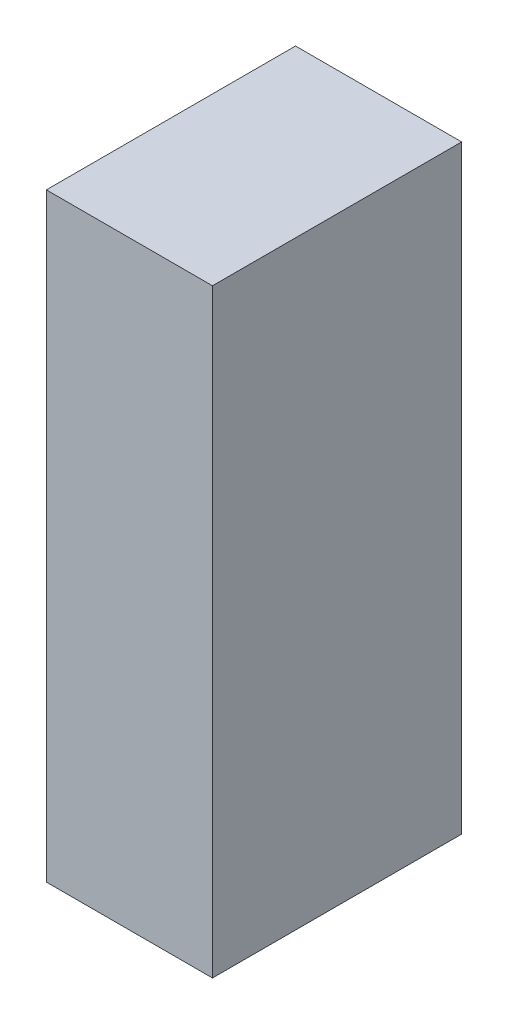
ISO-10303-21;
HEADER;
FILE_DESCRIPTION(('STEP AP214'),'2;1');
FILE_NAME('part.step','',(''),(''),'','','');
FILE_SCHEMA(('AUTOMOTIVE_DESIGN { 1 0 10303 214 1 1 1 1 }'));
ENDSEC;
DATA;
#1=APPLICATION_CONTEXT('core data for automotive mechanical design processes');
#2=APPLICATION_PROTOCOL_DEFINITION('international standard','automotive_design',2000,#1);
#3=PRODUCT_CONTEXT('',#1,'mechanical');
#4=PRODUCT('Part','Part','',(#3));
#5=PRODUCT_RELATED_PRODUCT_CATEGORY('part','',(#4));
#6=PRODUCT_DEFINITION_FORMATION('','',#4);
#7=PRODUCT_DEFINITION_CONTEXT('part definition',#1,'design');
#8=PRODUCT_DEFINITION('design','',#6,#7);
#9=PRODUCT_DEFINITION_SHAPE('','',#8);
#10=(LENGTH_UNIT() NAMED_UNIT(*) SI_UNIT(.MILLI.,.METRE.));
#11=(NAMED_UNIT(*) PLANE_ANGLE_UNIT() SI_UNIT($,.RADIAN.));
#12=(NAMED_UNIT(*) SI_UNIT($,.STERADIAN.) SOLID_ANGLE_UNIT());
#13=UNCERTAINTY_MEASURE_WITH_UNIT(LENGTH_MEASURE(1.E-05),#10,'distance_accuracy_value','');
#14=(GEOMETRIC_REPRESENTATION_CONTEXT(3) GLOBAL_UNCERTAINTY_ASSIGNED_CONTEXT((#13)) GLOBAL_UNIT_ASSIGNED_CONTEXT((#10,
#11,#12)) REPRESENTATION_CONTEXT('',''));
#15=CARTESIAN_POINT('',(0.,0.,0.));
#16=DIRECTION('',(0.,0.,1.));
#17=DIRECTION('',(1.,0.,0.));
#18=AXIS2_PLACEMENT_3D('',#15,#16,#17);
#19=CARTESIAN_POINT('',(0.07620254,0.27500072,0.));
#20=DIRECTION('',(1.,0.,0.));
#21=DIRECTION('',(0.,0.,-1.));
#22=AXIS2_PLACEMENT_3D('',#19,#20,#21);
#23=PLANE('',#22);
#24=DIRECTION('',(0.,0.,-1.));
#25=VECTOR('',#24,1.);
#26=CARTESIAN_POINT('',(0.07620254,-0.27500072,0.));
#27=LINE('',#26,#25);
#28=CARTESIAN_POINT('',(0.07620254,-0.27500072,0.));
#29=VERTEX_POINT('',#28);
#30=CARTESIAN_POINT('',(0.07620254,-0.27500072,0.2286));
#31=VERTEX_POINT('',#30);
#32=EDGE_CURVE('E20',#29,#31,#27,.F.);
#33=ORIENTED_EDGE('',*,*,#32,.F.);
#34=DIRECTION('',(0.,1.,0.));
#35=VECTOR('',#34,1.);
#36=CARTESIAN_POINT('',(0.07620254,-0.27500072,0.));
#37=LINE('',#36,#35);
#38=CARTESIAN_POINT('',(0.07620254,0.27500072,0.));
#39=VERTEX_POINT('',#38);
#40=EDGE_CURVE('E80',#29,#39,#37,.T.);
#41=ORIENTED_EDGE('',*,*,#40,.T.);
#42=DIRECTION('',(0.,0.,1.));
#43=VECTOR('',#42,1.);
#44=CARTESIAN_POINT('',(0.07620254,0.27500072,0.));
#45=LINE('',#44,#43);
#46=CARTESIAN_POINT('',(0.07620254,0.27500072,0.2286));
#47=VERTEX_POINT('',#46);
#48=EDGE_CURVE('E68',#47,#39,#45,.F.);
#49=ORIENTED_EDGE('',*,*,#48,.F.);
#50=DIRECTION('',(0.,1.,0.));
#51=VECTOR('',#50,1.);
#52=CARTESIAN_POINT('',(0.07620254,-0.27500072,0.2286));
#53=LINE('',#52,#51);
#54=EDGE_CURVE('E56',#31,#47,#53,.T.);
#55=ORIENTED_EDGE('',*,*,#54,.F.);
#56=EDGE_LOOP('',(#33,#41,#49,#55));
#57=FACE_BOUND('',#56,.T.);
#58=ADVANCED_FACE('F17',(#57),#23,.T.);
#59=CARTESIAN_POINT('',(0.07620254,-0.27500072,0.));
#60=DIRECTION('',(0.,-1.,0.));
#61=DIRECTION('',(0.,0.,-1.));
#62=AXIS2_PLACEMENT_3D('',#59,#60,#61);
#63=PLANE('',#62);
#64=DIRECTION('',(0.,0.,1.));
#65=VECTOR('',#64,1.);
#66=CARTESIAN_POINT('',(-0.07619746,-0.27500072,0.));
#67=LINE('',#66,#65);
#68=CARTESIAN_POINT('',(-0.0761980949999925,-0.27500072,0.));
#69=VERTEX_POINT('',#68);
#70=CARTESIAN_POINT('',(-0.0761980949999925,-0.27500072,0.2286));
#71=VERTEX_POINT('',#70);
#72=EDGE_CURVE('E83',#69,#71,#67,.T.);
#73=ORIENTED_EDGE('',*,*,#72,.F.);
#74=DIRECTION('',(1.,0.,0.));
#75=VECTOR('',#74,1.);
#76=CARTESIAN_POINT('',(-0.07619746,-0.27500072,0.));
#77=LINE('',#76,#75);
#78=EDGE_CURVE('E65',#69,#29,#77,.T.);
#79=ORIENTED_EDGE('',*,*,#78,.T.);
#80=ORIENTED_EDGE('',*,*,#32,.T.);
#81=DIRECTION('',(1.,0.,0.));
#82=VECTOR('',#81,1.);
#83=CARTESIAN_POINT('',(-0.07619746,-0.27500072,0.2286));
#84=LINE('',#83,#82);
#85=EDGE_CURVE('E62',#71,#31,#84,.T.);
#86=ORIENTED_EDGE('',*,*,#85,.F.);
#87=EDGE_LOOP('',(#73,#79,#80,#86));
#88=FACE_BOUND('',#87,.T.);
#89=ADVANCED_FACE('F61',(#88),#63,.T.);
#90=CARTESIAN_POINT('',(-0.07619746,-0.27500072,0.2286));
#91=DIRECTION('',(0.,0.,1.));
#92=DIRECTION('',(1.,0.,0.));
#93=AXIS2_PLACEMENT_3D('',#90,#91,#92);
#94=PLANE('',#93);
#95=DIRECTION('',(1.,0.,0.));
#96=VECTOR('',#95,1.);
#97=CARTESIAN_POINT('',(-0.07619999999997,0.27500072,0.2286));
#98=LINE('',#97,#96);
#99=CARTESIAN_POINT('',(-0.0761999999999697,0.27500072,0.2286));
#100=VERTEX_POINT('',#99);
#101=EDGE_CURVE('E70',#100,#47,#98,.T.);
#102=ORIENTED_EDGE('',*,*,#101,.F.);
#103=DIRECTION('',(4.61816966979355E-06,-0.999999999989336,0.));
#104=VECTOR('',#103,1.);
#105=CARTESIAN_POINT('',(-0.07619746,-0.27500072,0.2286));
#106=LINE('',#105,#104);
#107=EDGE_CURVE('E74',#71,#100,#106,.F.);
#108=ORIENTED_EDGE('',*,*,#107,.F.);
#109=ORIENTED_EDGE('',*,*,#85,.T.);
#110=ORIENTED_EDGE('',*,*,#54,.T.);
#111=EDGE_LOOP('',(#102,#108,#109,#110));
#112=FACE_BOUND('',#111,.T.);
#113=ADVANCED_FACE('F72',(#112),#94,.T.);
#114=CARTESIAN_POINT('',(-0.07619999999997,0.27500072,0.));
#115=DIRECTION('',(0.,1.,0.));
#116=DIRECTION('',(0.,0.,1.));
#117=AXIS2_PLACEMENT_3D('',#114,#115,#116);
#118=PLANE('',#117);
#119=ORIENTED_EDGE('',*,*,#48,.T.);
#120=DIRECTION('',(1.,0.,0.));
#121=VECTOR('',#120,1.);
#122=CARTESIAN_POINT('',(-0.07619746,0.27500072,0.));
#123=LINE('',#122,#121);
#124=CARTESIAN_POINT('',(-0.0761999999999697,0.27500072,0.));
#125=VERTEX_POINT('',#124);
#126=EDGE_CURVE('E35',#39,#125,#123,.F.);
#127=ORIENTED_EDGE('',*,*,#126,.T.);
#128=DIRECTION('',(0.,0.,1.));
#129=VECTOR('',#128,1.);
#130=CARTESIAN_POINT('',(-0.0761999999999686,0.27500072,0.));
#131=LINE('',#130,#129);
#132=EDGE_CURVE('E26',#100,#125,#131,.F.);
#133=ORIENTED_EDGE('',*,*,#132,.F.);
#134=ORIENTED_EDGE('',*,*,#101,.T.);
#135=EDGE_LOOP('',(#119,#127,#133,#134));
#136=FACE_BOUND('',#135,.T.);
#137=ADVANCED_FACE('F89',(#136),#118,.T.);
#138=CARTESIAN_POINT('',(-0.07619746,-0.27500072,0.));
#139=DIRECTION('',(0.,0.,1.));
#140=DIRECTION('',(1.,0.,0.));
#141=AXIS2_PLACEMENT_3D('',#138,#139,#140);
#142=PLANE('',#141);
#143=ORIENTED_EDGE('',*,*,#126,.F.);
#144=ORIENTED_EDGE('',*,*,#40,.F.);
#145=ORIENTED_EDGE('',*,*,#78,.F.);
#146=DIRECTION('',(4.61816966979355E-06,-0.999999999989336,0.));
#147=VECTOR('',#146,1.);
#148=CARTESIAN_POINT('',(-0.07619746,-0.27500072,0.));
#149=LINE('',#148,#147);
#150=EDGE_CURVE('E11',#125,#69,#149,.T.);
#151=ORIENTED_EDGE('',*,*,#150,.F.);
#152=EDGE_LOOP('',(#143,#144,#145,#151));
#153=FACE_BOUND('',#152,.T.);
#154=ADVANCED_FACE('F91',(#153),#142,.F.);
#155=CARTESIAN_POINT('',(-0.07619746,-0.27500072,0.));
#156=DIRECTION('',(-0.999999999989336,-4.61816966979355E-06,0.));
#157=DIRECTION('',(4.61816966979355E-06,-0.999999999989336,0.));
#158=AXIS2_PLACEMENT_3D('',#155,#156,#157);
#159=PLANE('',#158);
#160=ORIENTED_EDGE('',*,*,#132,.T.);
#161=ORIENTED_EDGE('',*,*,#150,.T.);
#162=ORIENTED_EDGE('',*,*,#72,.T.);
#163=ORIENTED_EDGE('',*,*,#107,.T.);
#164=EDGE_LOOP('',(#160,#161,#162,#163));
#165=FACE_BOUND('',#164,.T.);
#166=ADVANCED_FACE('F88',(#165),#159,.T.);
#167=CLOSED_SHELL('',(#58,#89,#113,#137,#154,#166));
#168=MANIFOLD_SOLID_BREP('B1',#167);
#169=ADVANCED_BREP_SHAPE_REPRESENTATION('',(#18,#168),#14);
#170=SHAPE_DEFINITION_REPRESENTATION(#9,#169);
ENDSEC;
END-ISO-10303-21;
